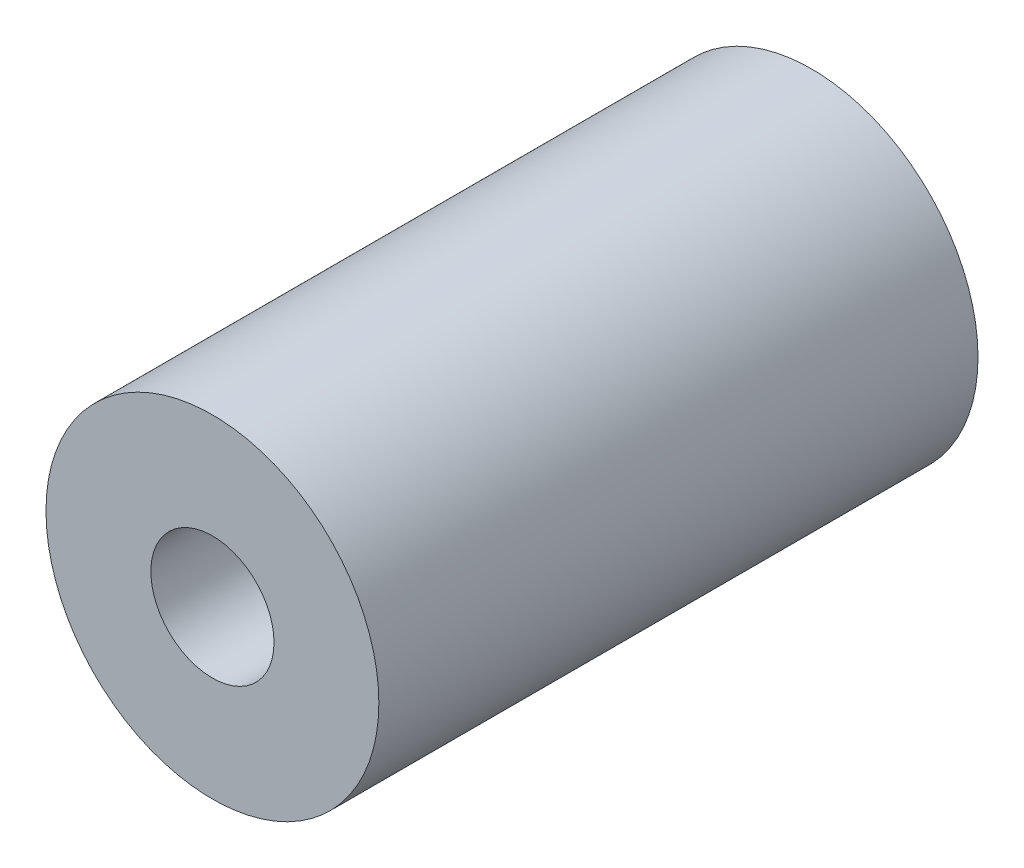
ISO-10303-21;
HEADER;
FILE_DESCRIPTION(('STEP AP214'),'2;1');
FILE_NAME('part.step','',(''),(''),'','','');
FILE_SCHEMA(('AUTOMOTIVE_DESIGN { 1 0 10303 214 1 1 1 1 }'));
ENDSEC;
DATA;
#1=APPLICATION_CONTEXT('core data for automotive mechanical design processes');
#2=APPLICATION_PROTOCOL_DEFINITION('international standard','automotive_design',2000,#1);
#3=PRODUCT_CONTEXT('',#1,'mechanical');
#4=PRODUCT('Part','Part','',(#3));
#5=PRODUCT_RELATED_PRODUCT_CATEGORY('part','',(#4));
#6=PRODUCT_DEFINITION_FORMATION('','',#4);
#7=PRODUCT_DEFINITION_CONTEXT('part definition',#1,'design');
#8=PRODUCT_DEFINITION('design','',#6,#7);
#9=PRODUCT_DEFINITION_SHAPE('','',#8);
#10=(LENGTH_UNIT() NAMED_UNIT(*) SI_UNIT(.MILLI.,.METRE.));
#11=(NAMED_UNIT(*) PLANE_ANGLE_UNIT() SI_UNIT($,.RADIAN.));
#12=(NAMED_UNIT(*) SI_UNIT($,.STERADIAN.) SOLID_ANGLE_UNIT());
#13=UNCERTAINTY_MEASURE_WITH_UNIT(LENGTH_MEASURE(1.E-05),#10,'distance_accuracy_value','');
#14=(GEOMETRIC_REPRESENTATION_CONTEXT(3) GLOBAL_UNCERTAINTY_ASSIGNED_CONTEXT((#13)) GLOBAL_UNIT_ASSIGNED_CONTEXT((#10,
#11,#12)) REPRESENTATION_CONTEXT('',''));
#15=CARTESIAN_POINT('',(0.,0.,0.));
#16=DIRECTION('',(0.,0.,1.));
#17=DIRECTION('',(1.,0.,0.));
#18=AXIS2_PLACEMENT_3D('',#15,#16,#17);
#19=CARTESIAN_POINT('',(0.,0.,18.));
#20=DIRECTION('',(0.,0.,1.));
#21=DIRECTION('',(1.,0.,0.));
#22=AXIS2_PLACEMENT_3D('',#19,#20,#21);
#23=PLANE('',#22);
#24=CARTESIAN_POINT('',(0.,0.,18.));
#25=DIRECTION('',(0.,0.,1.));
#26=DIRECTION('',(1.,0.,0.));
#27=AXIS2_PLACEMENT_3D('',#24,#25,#26);
#28=CIRCLE('',#27,5.);
#29=CARTESIAN_POINT('',(5.,0.,18.));
#30=VERTEX_POINT('',#29);
#31=EDGE_CURVE('E10',#30,#30,#28,.T.);
#32=ORIENTED_EDGE('',*,*,#31,.T.);
#33=EDGE_LOOP('',(#32));
#34=FACE_BOUND('',#33,.T.);
#35=CARTESIAN_POINT('',(0.,0.,18.));
#36=DIRECTION('',(0.,0.,1.));
#37=DIRECTION('',(1.,0.,0.));
#38=AXIS2_PLACEMENT_3D('',#35,#36,#37);
#39=CIRCLE('',#38,1.85);
#40=CARTESIAN_POINT('',(1.85,0.,18.));
#41=VERTEX_POINT('',#40);
#42=EDGE_CURVE('E42',#41,#41,#39,.T.);
#43=ORIENTED_EDGE('',*,*,#42,.F.);
#44=EDGE_LOOP('',(#43));
#45=FACE_BOUND('',#44,.T.);
#46=ADVANCED_FACE('F31',(#34,#45),#23,.T.);
#47=CARTESIAN_POINT('',(0.,0.,0.));
#48=DIRECTION('',(0.,0.,1.));
#49=DIRECTION('',(1.,0.,0.));
#50=AXIS2_PLACEMENT_3D('',#47,#48,#49);
#51=PLANE('',#50);
#52=CARTESIAN_POINT('',(0.,0.,0.));
#53=DIRECTION('',(0.,0.,1.));
#54=DIRECTION('',(1.,0.,0.));
#55=AXIS2_PLACEMENT_3D('',#52,#53,#54);
#56=CIRCLE('',#55,5.);
#57=CARTESIAN_POINT('',(5.,0.,0.));
#58=VERTEX_POINT('',#57);
#59=EDGE_CURVE('E35',#58,#58,#56,.T.);
#60=ORIENTED_EDGE('',*,*,#59,.F.);
#61=EDGE_LOOP('',(#60));
#62=FACE_BOUND('',#61,.T.);
#63=CARTESIAN_POINT('',(0.,0.,0.));
#64=DIRECTION('',(0.,0.,1.));
#65=DIRECTION('',(1.,0.,0.));
#66=AXIS2_PLACEMENT_3D('',#63,#64,#65);
#67=CIRCLE('',#66,1.85);
#68=CARTESIAN_POINT('',(1.85,0.,0.));
#69=VERTEX_POINT('',#68);
#70=EDGE_CURVE('E44',#69,#69,#67,.T.);
#71=ORIENTED_EDGE('',*,*,#70,.T.);
#72=EDGE_LOOP('',(#71));
#73=FACE_BOUND('',#72,.T.);
#74=ADVANCED_FACE('F54',(#62,#73),#51,.F.);
#75=CARTESIAN_POINT('',(0.,0.,18.));
#76=DIRECTION('',(0.,0.,-1.));
#77=DIRECTION('',(-1.,0.,0.));
#78=AXIS2_PLACEMENT_3D('',#75,#76,#77);
#79=CYLINDRICAL_SURFACE('',#78,5.);
#80=ORIENTED_EDGE('',*,*,#31,.F.);
#81=EDGE_LOOP('',(#80));
#82=FACE_BOUND('',#81,.T.);
#83=ORIENTED_EDGE('',*,*,#59,.T.);
#84=EDGE_LOOP('',(#83));
#85=FACE_BOUND('',#84,.T.);
#86=ADVANCED_FACE('F33',(#82,#85),#79,.T.);
#87=CARTESIAN_POINT('',(0.,0.,18.));
#88=DIRECTION('',(0.,0.,-1.));
#89=DIRECTION('',(-1.,0.,0.));
#90=AXIS2_PLACEMENT_3D('',#87,#88,#89);
#91=CYLINDRICAL_SURFACE('',#90,1.85);
#92=ORIENTED_EDGE('',*,*,#42,.T.);
#93=EDGE_LOOP('',(#92));
#94=FACE_BOUND('',#93,.T.);
#95=ORIENTED_EDGE('',*,*,#70,.F.);
#96=EDGE_LOOP('',(#95));
#97=FACE_BOUND('',#96,.T.);
#98=ADVANCED_FACE('F50',(#94,#97),#91,.F.);
#99=CLOSED_SHELL('',(#46,#74,#86,#98));
#100=MANIFOLD_SOLID_BREP('B2',#99);
#101=ADVANCED_BREP_SHAPE_REPRESENTATION('',(#18,#100),#14);
#102=SHAPE_DEFINITION_REPRESENTATION(#9,#101);
ENDSEC;
END-ISO-10303-21;
